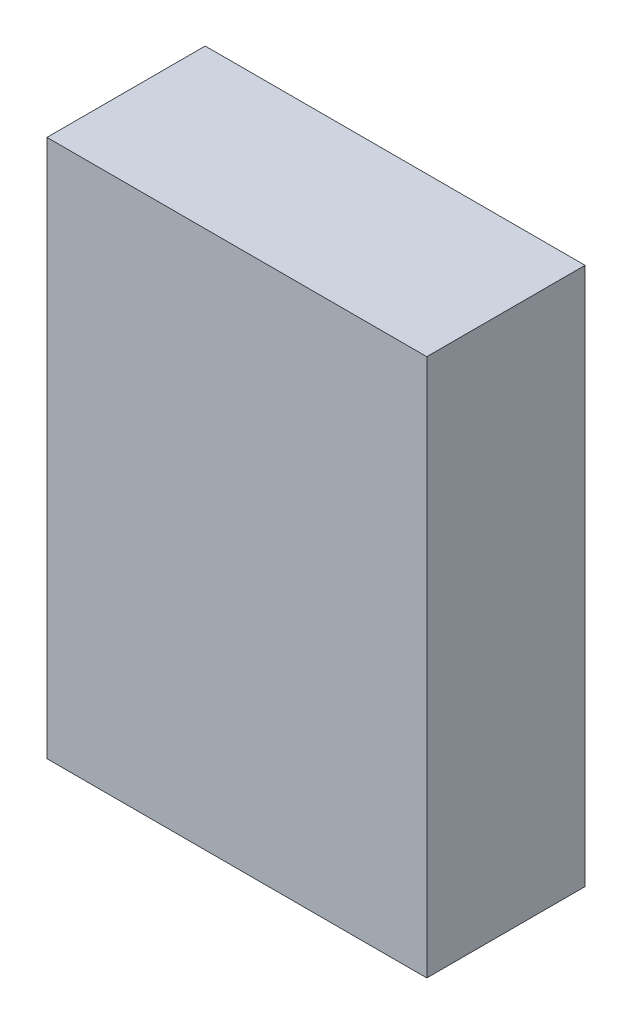
ISO-10303-21;
HEADER;
FILE_DESCRIPTION(('STEP AP214'),'2;1');
FILE_NAME('part.step','',(''),(''),'','','');
FILE_SCHEMA(('AUTOMOTIVE_DESIGN { 1 0 10303 214 1 1 1 1 }'));
ENDSEC;
DATA;
#1=APPLICATION_CONTEXT('core data for automotive mechanical design processes');
#2=APPLICATION_PROTOCOL_DEFINITION('international standard','automotive_design',2000,#1);
#3=PRODUCT_CONTEXT('',#1,'mechanical');
#4=PRODUCT('Part','Part','',(#3));
#5=PRODUCT_RELATED_PRODUCT_CATEGORY('part','',(#4));
#6=PRODUCT_DEFINITION_FORMATION('','',#4);
#7=PRODUCT_DEFINITION_CONTEXT('part definition',#1,'design');
#8=PRODUCT_DEFINITION('design','',#6,#7);
#9=PRODUCT_DEFINITION_SHAPE('','',#8);
#10=(LENGTH_UNIT() NAMED_UNIT(*) SI_UNIT(.MILLI.,.METRE.));
#11=(NAMED_UNIT(*) PLANE_ANGLE_UNIT() SI_UNIT($,.RADIAN.));
#12=(NAMED_UNIT(*) SI_UNIT($,.STERADIAN.) SOLID_ANGLE_UNIT());
#13=UNCERTAINTY_MEASURE_WITH_UNIT(LENGTH_MEASURE(1.E-05),#10,'distance_accuracy_value','');
#14=(GEOMETRIC_REPRESENTATION_CONTEXT(3) GLOBAL_UNCERTAINTY_ASSIGNED_CONTEXT((#13)) GLOBAL_UNIT_ASSIGNED_CONTEXT((#10,
#11,#12)) REPRESENTATION_CONTEXT('',''));
#15=CARTESIAN_POINT('',(0.,0.,0.));
#16=DIRECTION('',(0.,0.,1.));
#17=DIRECTION('',(1.,0.,0.));
#18=AXIS2_PLACEMENT_3D('',#15,#16,#17);
#19=CARTESIAN_POINT('',(-0.37,-2.92,0.));
#20=DIRECTION('',(1.,0.,0.));
#21=DIRECTION('',(0.,0.,1.));
#22=AXIS2_PLACEMENT_3D('',#19,#20,#21);
#23=PLANE('',#22);
#24=DIRECTION('',(0.,1.,0.));
#25=VECTOR('',#24,1.);
#26=CARTESIAN_POINT('',(-0.37,-2.92,0.1));
#27=LINE('',#26,#25);
#28=CARTESIAN_POINT('',(-0.37,-2.92,0.1));
#29=VERTEX_POINT('',#28);
#30=CARTESIAN_POINT('',(-0.37,-2.58,0.1));
#31=VERTEX_POINT('',#30);
#32=EDGE_CURVE('E11',#29,#31,#27,.T.);
#33=ORIENTED_EDGE('',*,*,#32,.T.);
#34=DIRECTION('',(0.,0.,1.));
#35=VECTOR('',#34,1.);
#36=CARTESIAN_POINT('',(-0.37,-2.58,0.));
#37=LINE('',#36,#35);
#38=CARTESIAN_POINT('',(-0.37,-2.58,0.));
#39=VERTEX_POINT('',#38);
#40=EDGE_CURVE('E24',#39,#31,#37,.T.);
#41=ORIENTED_EDGE('',*,*,#40,.F.);
#42=DIRECTION('',(0.,1.,0.));
#43=VECTOR('',#42,1.);
#44=CARTESIAN_POINT('',(-0.37,-2.92,0.));
#45=LINE('',#44,#43);
#46=CARTESIAN_POINT('',(-0.37,-2.92,0.));
#47=VERTEX_POINT('',#46);
#48=EDGE_CURVE('E86',#47,#39,#45,.T.);
#49=ORIENTED_EDGE('',*,*,#48,.F.);
#50=DIRECTION('',(0.,0.,1.));
#51=VECTOR('',#50,1.);
#52=CARTESIAN_POINT('',(-0.37,-2.92,0.));
#53=LINE('',#52,#51);
#54=EDGE_CURVE('E36',#47,#29,#53,.T.);
#55=ORIENTED_EDGE('',*,*,#54,.T.);
#56=EDGE_LOOP('',(#33,#41,#49,#55));
#57=FACE_BOUND('',#56,.T.);
#58=ADVANCED_FACE('F17',(#57),#23,.F.);
#59=CARTESIAN_POINT('',(-0.13,-2.92,0.));
#60=DIRECTION('',(1.,0.,0.));
#61=DIRECTION('',(0.,0.,1.));
#62=AXIS2_PLACEMENT_3D('',#59,#60,#61);
#63=PLANE('',#62);
#64=DIRECTION('',(0.,0.,1.));
#65=VECTOR('',#64,1.);
#66=CARTESIAN_POINT('',(-0.13,-2.92,0.));
#67=LINE('',#66,#65);
#68=CARTESIAN_POINT('',(-0.13,-2.92,0.));
#69=VERTEX_POINT('',#68);
#70=CARTESIAN_POINT('',(-0.13,-2.92,0.1));
#71=VERTEX_POINT('',#70);
#72=EDGE_CURVE('E83',#69,#71,#67,.T.);
#73=ORIENTED_EDGE('',*,*,#72,.F.);
#74=DIRECTION('',(0.,1.,0.));
#75=VECTOR('',#74,1.);
#76=CARTESIAN_POINT('',(-0.13,-2.92,0.));
#77=LINE('',#76,#75);
#78=CARTESIAN_POINT('',(-0.13,-2.58,0.));
#79=VERTEX_POINT('',#78);
#80=EDGE_CURVE('E63',#69,#79,#77,.T.);
#81=ORIENTED_EDGE('',*,*,#80,.T.);
#82=DIRECTION('',(0.,0.,1.));
#83=VECTOR('',#82,1.);
#84=CARTESIAN_POINT('',(-0.13,-2.58,0.));
#85=LINE('',#84,#83);
#86=CARTESIAN_POINT('',(-0.13,-2.58,0.1));
#87=VERTEX_POINT('',#86);
#88=EDGE_CURVE('E57',#79,#87,#85,.T.);
#89=ORIENTED_EDGE('',*,*,#88,.T.);
#90=DIRECTION('',(0.,1.,0.));
#91=VECTOR('',#90,1.);
#92=CARTESIAN_POINT('',(-0.13,-2.92,0.1));
#93=LINE('',#92,#91);
#94=EDGE_CURVE('E60',#71,#87,#93,.T.);
#95=ORIENTED_EDGE('',*,*,#94,.F.);
#96=EDGE_LOOP('',(#73,#81,#89,#95));
#97=FACE_BOUND('',#96,.T.);
#98=ADVANCED_FACE('F59',(#97),#63,.T.);
#99=CARTESIAN_POINT('',(-0.37,-2.92,0.));
#100=DIRECTION('',(0.,1.,0.));
#101=DIRECTION('',(0.,0.,1.));
#102=AXIS2_PLACEMENT_3D('',#99,#100,#101);
#103=PLANE('',#102);
#104=ORIENTED_EDGE('',*,*,#72,.T.);
#105=DIRECTION('',(1.,0.,0.));
#106=VECTOR('',#105,1.);
#107=CARTESIAN_POINT('',(-0.37,-2.92,0.1));
#108=LINE('',#107,#106);
#109=EDGE_CURVE('E71',#29,#71,#108,.T.);
#110=ORIENTED_EDGE('',*,*,#109,.F.);
#111=ORIENTED_EDGE('',*,*,#54,.F.);
#112=DIRECTION('',(1.,0.,0.));
#113=VECTOR('',#112,1.);
#114=CARTESIAN_POINT('',(-0.37,-2.92,0.));
#115=LINE('',#114,#113);
#116=EDGE_CURVE('E76',#47,#69,#115,.T.);
#117=ORIENTED_EDGE('',*,*,#116,.T.);
#118=EDGE_LOOP('',(#104,#110,#111,#117));
#119=FACE_BOUND('',#118,.T.);
#120=ADVANCED_FACE('F91',(#119),#103,.F.);
#121=CARTESIAN_POINT('',(-0.37,-2.58,0.));
#122=DIRECTION('',(0.,1.,0.));
#123=DIRECTION('',(0.,0.,1.));
#124=AXIS2_PLACEMENT_3D('',#121,#122,#123);
#125=PLANE('',#124);
#126=DIRECTION('',(1.,0.,0.));
#127=VECTOR('',#126,1.);
#128=CARTESIAN_POINT('',(-0.37,-2.58,0.));
#129=LINE('',#128,#127);
#130=EDGE_CURVE('E74',#39,#79,#129,.T.);
#131=ORIENTED_EDGE('',*,*,#130,.F.);
#132=ORIENTED_EDGE('',*,*,#40,.T.);
#133=DIRECTION('',(1.,0.,0.));
#134=VECTOR('',#133,1.);
#135=CARTESIAN_POINT('',(-0.37,-2.58,0.1));
#136=LINE('',#135,#134);
#137=EDGE_CURVE('E69',#31,#87,#136,.T.);
#138=ORIENTED_EDGE('',*,*,#137,.T.);
#139=ORIENTED_EDGE('',*,*,#88,.F.);
#140=EDGE_LOOP('',(#131,#132,#138,#139));
#141=FACE_BOUND('',#140,.T.);
#142=ADVANCED_FACE('F73',(#141),#125,.T.);
#143=CARTESIAN_POINT('',(-0.37,-2.92,0.));
#144=DIRECTION('',(0.,0.,1.));
#145=DIRECTION('',(1.,0.,0.));
#146=AXIS2_PLACEMENT_3D('',#143,#144,#145);
#147=PLANE('',#146);
#148=ORIENTED_EDGE('',*,*,#130,.T.);
#149=ORIENTED_EDGE('',*,*,#80,.F.);
#150=ORIENTED_EDGE('',*,*,#116,.F.);
#151=ORIENTED_EDGE('',*,*,#48,.T.);
#152=EDGE_LOOP('',(#148,#149,#150,#151));
#153=FACE_BOUND('',#152,.T.);
#154=ADVANCED_FACE('F89',(#153),#147,.F.);
#155=CARTESIAN_POINT('',(-0.37,-2.92,0.1));
#156=DIRECTION('',(0.,0.,1.));
#157=DIRECTION('',(1.,0.,0.));
#158=AXIS2_PLACEMENT_3D('',#155,#156,#157);
#159=PLANE('',#158);
#160=ORIENTED_EDGE('',*,*,#32,.F.);
#161=ORIENTED_EDGE('',*,*,#109,.T.);
#162=ORIENTED_EDGE('',*,*,#94,.T.);
#163=ORIENTED_EDGE('',*,*,#137,.F.);
#164=EDGE_LOOP('',(#160,#161,#162,#163));
#165=FACE_BOUND('',#164,.T.);
#166=ADVANCED_FACE('F68',(#165),#159,.T.);
#167=CLOSED_SHELL('',(#58,#98,#120,#142,#154,#166));
#168=MANIFOLD_SOLID_BREP('B1',#167);
#169=ADVANCED_BREP_SHAPE_REPRESENTATION('',(#18,#168),#14);
#170=SHAPE_DEFINITION_REPRESENTATION(#9,#169);
ENDSEC;
END-ISO-10303-21;
